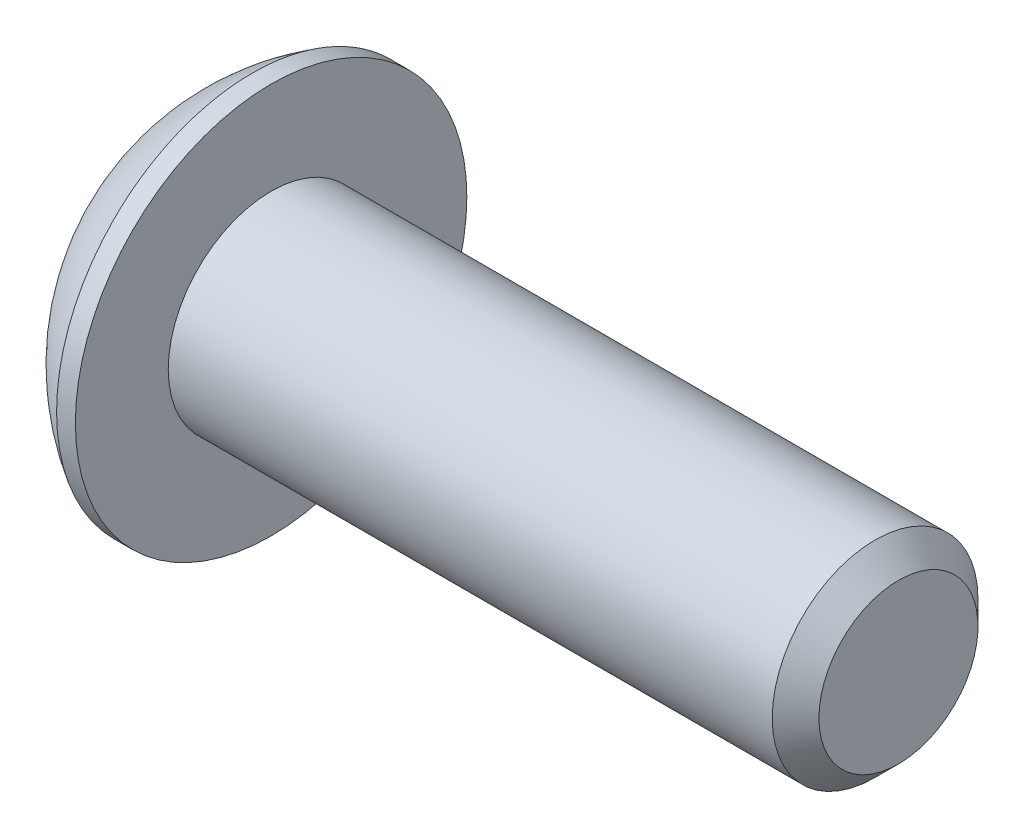
ISO-10303-21;
HEADER;
FILE_DESCRIPTION(('STEP AP214'),'2;1');
FILE_NAME('part.step','',(''),(''),'','','');
FILE_SCHEMA(('AUTOMOTIVE_DESIGN { 1 0 10303 214 1 1 1 1 }'));
ENDSEC;
DATA;
#1=APPLICATION_CONTEXT('core data for automotive mechanical design processes');
#2=APPLICATION_PROTOCOL_DEFINITION('international standard','automotive_design',2000,#1);
#3=PRODUCT_CONTEXT('',#1,'mechanical');
#4=PRODUCT('Part','Part','',(#3));
#5=PRODUCT_RELATED_PRODUCT_CATEGORY('part','',(#4));
#6=PRODUCT_DEFINITION_FORMATION('','',#4);
#7=PRODUCT_DEFINITION_CONTEXT('part definition',#1,'design');
#8=PRODUCT_DEFINITION('design','',#6,#7);
#9=PRODUCT_DEFINITION_SHAPE('','',#8);
#10=(LENGTH_UNIT() NAMED_UNIT(*) SI_UNIT(.MILLI.,.METRE.));
#11=(NAMED_UNIT(*) PLANE_ANGLE_UNIT() SI_UNIT($,.RADIAN.));
#12=(NAMED_UNIT(*) SI_UNIT($,.STERADIAN.) SOLID_ANGLE_UNIT());
#13=UNCERTAINTY_MEASURE_WITH_UNIT(LENGTH_MEASURE(1.E-05),#10,'distance_accuracy_value','');
#14=(GEOMETRIC_REPRESENTATION_CONTEXT(3) GLOBAL_UNCERTAINTY_ASSIGNED_CONTEXT((#13)) GLOBAL_UNIT_ASSIGNED_CONTEXT((#10,
#11,#12)) REPRESENTATION_CONTEXT('',''));
#15=CARTESIAN_POINT('',(0.,0.,0.));
#16=DIRECTION('',(0.,0.,1.));
#17=DIRECTION('',(1.,0.,0.));
#18=AXIS2_PLACEMENT_3D('',#15,#16,#17);
#19=CARTESIAN_POINT('',(1.32080000000034,0.,0.));
#20=DIRECTION('',(-1.,0.,0.));
#21=DIRECTION('',(0.,0.,1.));
#22=AXIS2_PLACEMENT_3D('',#19,#20,#21);
#23=CONICAL_SURFACE('',#22,1.1937999999998,1.04719755119608);
#24=CARTESIAN_POINT('',(2.01004075135902,0.,4.44089209850063E-13));
#25=VERTEX_POINT('',#24);
#26=VERTEX_LOOP('',#25);
#27=FACE_BOUND('',#26,.T.);
#28=CARTESIAN_POINT('',(1.32080000000009,0.,0.));
#29=DIRECTION('',(-1.,0.,0.));
#30=DIRECTION('',(0.,0.,1.));
#31=AXIS2_PLACEMENT_3D('',#28,#29,#30);
#32=CIRCLE('',#31,1.19380000000024);
#33=CARTESIAN_POINT('',(1.32080000000004,0.,1.19380000000012));
#34=VERTEX_POINT('',#33);
#35=CARTESIAN_POINT('',(1.32080000000004,-1.03386112703797,0.596900000000061));
#36=VERTEX_POINT('',#35);
#37=EDGE_CURVE('E21',#34,#36,#32,.F.);
#38=ORIENTED_EDGE('',*,*,#37,.F.);
#39=CARTESIAN_POINT('',(1.32080000000009,0.,0.));
#40=DIRECTION('',(-1.,0.,0.));
#41=DIRECTION('',(0.,0.,1.));
#42=AXIS2_PLACEMENT_3D('',#39,#40,#41);
#43=CIRCLE('',#42,1.19380000000024);
#44=CARTESIAN_POINT('',(1.32080000000004,1.03386112703797,0.596900000000063));
#45=VERTEX_POINT('',#44);
#46=EDGE_CURVE('E91',#45,#34,#43,.F.);
#47=ORIENTED_EDGE('',*,*,#46,.F.);
#48=CARTESIAN_POINT('',(1.32080000000009,0.,0.));
#49=DIRECTION('',(-1.,0.,0.));
#50=DIRECTION('',(0.,0.,1.));
#51=AXIS2_PLACEMENT_3D('',#48,#49,#50);
#52=CIRCLE('',#51,1.19380000000024);
#53=CARTESIAN_POINT('',(1.32080000000004,1.03386112703797,-0.596900000000063));
#54=VERTEX_POINT('',#53);
#55=EDGE_CURVE('E107',#54,#45,#52,.F.);
#56=ORIENTED_EDGE('',*,*,#55,.F.);
#57=CARTESIAN_POINT('',(1.32080000000009,0.,0.));
#58=DIRECTION('',(-1.,0.,0.));
#59=DIRECTION('',(0.,0.,1.));
#60=AXIS2_PLACEMENT_3D('',#57,#58,#59);
#61=CIRCLE('',#60,1.19380000000024);
#62=CARTESIAN_POINT('',(1.32080000000004,1.49420287879031E-12,-1.19380000000012));
#63=VERTEX_POINT('',#62);
#64=EDGE_CURVE('E405',#63,#54,#61,.F.);
#65=ORIENTED_EDGE('',*,*,#64,.F.);
#66=CARTESIAN_POINT('',(1.32080000000009,0.,0.));
#67=DIRECTION('',(-1.,0.,0.));
#68=DIRECTION('',(0.,0.,1.));
#69=AXIS2_PLACEMENT_3D('',#66,#67,#68);
#70=CIRCLE('',#69,1.19380000000024);
#71=CARTESIAN_POINT('',(1.32080000000004,-1.03386112703797,-0.596900000000062));
#72=VERTEX_POINT('',#71);
#73=EDGE_CURVE('E408',#72,#63,#70,.F.);
#74=ORIENTED_EDGE('',*,*,#73,.F.);
#75=CARTESIAN_POINT('',(1.32080000000009,0.,0.));
#76=DIRECTION('',(-1.,0.,0.));
#77=DIRECTION('',(0.,0.,1.));
#78=AXIS2_PLACEMENT_3D('',#75,#76,#77);
#79=CIRCLE('',#78,1.19380000000024);
#80=EDGE_CURVE('E94',#36,#72,#79,.F.);
#81=ORIENTED_EDGE('',*,*,#80,.F.);
#82=EDGE_LOOP('',(#38,#47,#56,#65,#74,#81));
#83=FACE_BOUND('',#82,.T.);
#84=ADVANCED_FACE('F18',(#27,#83),#23,.F.);
#85=CARTESIAN_POINT('',(1.3208,0.,2.3876));
#86=DIRECTION('',(-1.,0.,0.));
#87=DIRECTION('',(0.,0.,1.));
#88=AXIS2_PLACEMENT_3D('',#85,#86,#87);
#89=PLANE('',#88);
#90=DIRECTION('',(0.,1.,0.));
#91=VECTOR('',#90,1.);
#92=CARTESIAN_POINT('',(1.3208,-0.689240751358576,1.1938));
#93=LINE('',#92,#91);
#94=CARTESIAN_POINT('',(1.3208,-0.689240751358576,1.1938));
#95=VERTEX_POINT('',#94);
#96=EDGE_CURVE('E110',#34,#95,#93,.F.);
#97=ORIENTED_EDGE('',*,*,#96,.F.);
#98=ORIENTED_EDGE('',*,*,#37,.T.);
#99=DIRECTION('',(0.,0.5,0.866025403784439));
#100=VECTOR('',#99,1.);
#101=CARTESIAN_POINT('',(1.3208,-1.37848150271715,0.));
#102=LINE('',#101,#100);
#103=EDGE_CURVE('E113',#95,#36,#102,.F.);
#104=ORIENTED_EDGE('',*,*,#103,.F.);
#105=EDGE_LOOP('',(#97,#98,#104));
#106=FACE_BOUND('',#105,.T.);
#107=ADVANCED_FACE('F111',(#106),#89,.T.);
#108=CARTESIAN_POINT('',(1.3208,0.,2.3876));
#109=DIRECTION('',(-1.,0.,0.));
#110=DIRECTION('',(0.,0.,1.));
#111=AXIS2_PLACEMENT_3D('',#108,#109,#110);
#112=PLANE('',#111);
#113=DIRECTION('',(0.,0.5,0.866025403784439));
#114=VECTOR('',#113,1.);
#115=CARTESIAN_POINT('',(1.3208,-1.37848150271715,0.));
#116=LINE('',#115,#114);
#117=CARTESIAN_POINT('',(1.3208,-1.37848150271715,0.));
#118=VERTEX_POINT('',#117);
#119=EDGE_CURVE('E173',#36,#118,#116,.F.);
#120=ORIENTED_EDGE('',*,*,#119,.F.);
#121=ORIENTED_EDGE('',*,*,#80,.T.);
#122=DIRECTION('',(0.,-0.5,0.866025403784439));
#123=VECTOR('',#122,1.);
#124=CARTESIAN_POINT('',(1.3208,-0.689240751358576,-1.1938));
#125=LINE('',#124,#123);
#126=EDGE_CURVE('E161',#118,#72,#125,.F.);
#127=ORIENTED_EDGE('',*,*,#126,.F.);
#128=EDGE_LOOP('',(#120,#121,#127));
#129=FACE_BOUND('',#128,.T.);
#130=ADVANCED_FACE('F250',(#129),#112,.T.);
#131=CARTESIAN_POINT('',(1.3208,0.,2.3876));
#132=DIRECTION('',(-1.,0.,0.));
#133=DIRECTION('',(0.,0.,1.));
#134=AXIS2_PLACEMENT_3D('',#131,#132,#133);
#135=PLANE('',#134);
#136=DIRECTION('',(0.,-0.5,0.866025403784439));
#137=VECTOR('',#136,1.);
#138=CARTESIAN_POINT('',(1.3208,-0.689240751358576,-1.1938));
#139=LINE('',#138,#137);
#140=CARTESIAN_POINT('',(1.3208,-0.689240751358576,-1.1938));
#141=VERTEX_POINT('',#140);
#142=EDGE_CURVE('E158',#72,#141,#139,.F.);
#143=ORIENTED_EDGE('',*,*,#142,.F.);
#144=ORIENTED_EDGE('',*,*,#73,.T.);
#145=DIRECTION('',(0.,-1.,0.));
#146=VECTOR('',#145,1.);
#147=CARTESIAN_POINT('',(1.3208,0.689240751358575,-1.1938));
#148=LINE('',#147,#146);
#149=EDGE_CURVE('E145',#141,#63,#148,.F.);
#150=ORIENTED_EDGE('',*,*,#149,.F.);
#151=EDGE_LOOP('',(#143,#144,#150));
#152=FACE_BOUND('',#151,.T.);
#153=ADVANCED_FACE('F246',(#152),#135,.T.);
#154=CARTESIAN_POINT('',(1.3208,0.,2.3876));
#155=DIRECTION('',(-1.,0.,0.));
#156=DIRECTION('',(0.,0.,1.));
#157=AXIS2_PLACEMENT_3D('',#154,#155,#156);
#158=PLANE('',#157);
#159=DIRECTION('',(0.,-1.,0.));
#160=VECTOR('',#159,1.);
#161=CARTESIAN_POINT('',(1.3208,0.689240751358575,-1.1938));
#162=LINE('',#161,#160);
#163=CARTESIAN_POINT('',(1.3208,0.689240751358575,-1.1938));
#164=VERTEX_POINT('',#163);
#165=EDGE_CURVE('E142',#63,#164,#162,.F.);
#166=ORIENTED_EDGE('',*,*,#165,.F.);
#167=ORIENTED_EDGE('',*,*,#64,.T.);
#168=DIRECTION('',(0.,-0.500000000000001,-0.866025403784438));
#169=VECTOR('',#168,1.);
#170=CARTESIAN_POINT('',(1.3208,1.37848150271715,0.));
#171=LINE('',#170,#169);
#172=EDGE_CURVE('E130',#164,#54,#171,.F.);
#173=ORIENTED_EDGE('',*,*,#172,.F.);
#174=EDGE_LOOP('',(#166,#167,#173));
#175=FACE_BOUND('',#174,.T.);
#176=ADVANCED_FACE('F242',(#175),#158,.T.);
#177=CARTESIAN_POINT('',(1.3208,0.,2.3876));
#178=DIRECTION('',(-1.,0.,0.));
#179=DIRECTION('',(0.,0.,1.));
#180=AXIS2_PLACEMENT_3D('',#177,#178,#179);
#181=PLANE('',#180);
#182=DIRECTION('',(0.,-0.500000000000001,-0.866025403784438));
#183=VECTOR('',#182,1.);
#184=CARTESIAN_POINT('',(1.3208,1.37848150271715,0.));
#185=LINE('',#184,#183);
#186=CARTESIAN_POINT('',(1.3208,1.37848150271715,0.));
#187=VERTEX_POINT('',#186);
#188=EDGE_CURVE('E127',#54,#187,#185,.F.);
#189=ORIENTED_EDGE('',*,*,#188,.F.);
#190=ORIENTED_EDGE('',*,*,#55,.T.);
#191=DIRECTION('',(0.,0.500000000000001,-0.866025403784438));
#192=VECTOR('',#191,1.);
#193=CARTESIAN_POINT('',(1.3208,0.689240751358575,1.1938));
#194=LINE('',#193,#192);
#195=EDGE_CURVE('E150',#187,#45,#194,.F.);
#196=ORIENTED_EDGE('',*,*,#195,.F.);
#197=EDGE_LOOP('',(#189,#190,#196));
#198=FACE_BOUND('',#197,.T.);
#199=ADVANCED_FACE('F239',(#198),#181,.T.);
#200=CARTESIAN_POINT('',(1.3208,0.,2.3876));
#201=DIRECTION('',(-1.,0.,0.));
#202=DIRECTION('',(0.,0.,1.));
#203=AXIS2_PLACEMENT_3D('',#200,#201,#202);
#204=PLANE('',#203);
#205=DIRECTION('',(0.,0.500000000000001,-0.866025403784438));
#206=VECTOR('',#205,1.);
#207=CARTESIAN_POINT('',(1.3208,0.689240751358575,1.1938));
#208=LINE('',#207,#206);
#209=CARTESIAN_POINT('',(1.3208,0.689240751358575,1.1938));
#210=VERTEX_POINT('',#209);
#211=EDGE_CURVE('E105',#45,#210,#208,.F.);
#212=ORIENTED_EDGE('',*,*,#211,.F.);
#213=ORIENTED_EDGE('',*,*,#46,.T.);
#214=DIRECTION('',(0.,1.,0.));
#215=VECTOR('',#214,1.);
#216=CARTESIAN_POINT('',(1.3208,-0.689240751358576,1.1938));
#217=LINE('',#216,#215);
#218=EDGE_CURVE('E102',#210,#34,#217,.F.);
#219=ORIENTED_EDGE('',*,*,#218,.F.);
#220=EDGE_LOOP('',(#212,#213,#219));
#221=FACE_BOUND('',#220,.T.);
#222=ADVANCED_FACE('F100',(#221),#204,.T.);
#223=CARTESIAN_POINT('',(1.3208,-0.689240751358576,1.1938));
#224=DIRECTION('',(0.,0.,-1.));
#225=DIRECTION('',(0.,1.,0.));
#226=AXIS2_PLACEMENT_3D('',#223,#224,#225);
#227=PLANE('',#226);
#228=DIRECTION('',(0.,1.,0.));
#229=VECTOR('',#228,1.);
#230=CARTESIAN_POINT('',(0.,0.,1.1938));
#231=LINE('',#230,#229);
#232=CARTESIAN_POINT('',(0.,0.689240751358575,1.1938));
#233=VERTEX_POINT('',#232);
#234=CARTESIAN_POINT('',(0.,-0.689240751358576,1.1938));
#235=VERTEX_POINT('',#234);
#236=EDGE_CURVE('E134',#233,#235,#231,.F.);
#237=ORIENTED_EDGE('',*,*,#236,.F.);
#238=DIRECTION('',(1.,0.,0.));
#239=VECTOR('',#238,1.);
#240=CARTESIAN_POINT('',(1.3208,0.689240751358575,1.1938));
#241=LINE('',#240,#239);
#242=EDGE_CURVE('E119',#210,#233,#241,.F.);
#243=ORIENTED_EDGE('',*,*,#242,.F.);
#244=ORIENTED_EDGE('',*,*,#218,.T.);
#245=ORIENTED_EDGE('',*,*,#96,.T.);
#246=DIRECTION('',(1.,0.,0.));
#247=VECTOR('',#246,1.);
#248=CARTESIAN_POINT('',(1.3208,-0.689240751358576,1.1938));
#249=LINE('',#248,#247);
#250=EDGE_CURVE('E170',#235,#95,#249,.T.);
#251=ORIENTED_EDGE('',*,*,#250,.F.);
#252=EDGE_LOOP('',(#237,#243,#244,#245,#251));
#253=FACE_BOUND('',#252,.T.);
#254=ADVANCED_FACE('F117',(#253),#227,.T.);
#255=CARTESIAN_POINT('',(1.3208,-1.37848150271715,0.));
#256=DIRECTION('',(0.,0.866025403784439,-0.5));
#257=DIRECTION('',(0.,0.5,0.866025403784439));
#258=AXIS2_PLACEMENT_3D('',#255,#256,#257);
#259=PLANE('',#258);
#260=DIRECTION('',(0.,-0.5,-0.866025403784439));
#261=VECTOR('',#260,1.);
#262=CARTESIAN_POINT('',(0.,-0.689240751358576,1.1938));
#263=LINE('',#262,#261);
#264=CARTESIAN_POINT('',(0.,-1.37848150271715,0.));
#265=VERTEX_POINT('',#264);
#266=EDGE_CURVE('E392',#235,#265,#263,.T.);
#267=ORIENTED_EDGE('',*,*,#266,.F.);
#268=ORIENTED_EDGE('',*,*,#250,.T.);
#269=ORIENTED_EDGE('',*,*,#103,.T.);
#270=ORIENTED_EDGE('',*,*,#119,.T.);
#271=DIRECTION('',(1.,0.,0.));
#272=VECTOR('',#271,1.);
#273=CARTESIAN_POINT('',(1.3208,-1.37848150271715,0.));
#274=LINE('',#273,#272);
#275=EDGE_CURVE('E155',#265,#118,#274,.T.);
#276=ORIENTED_EDGE('',*,*,#275,.F.);
#277=EDGE_LOOP('',(#267,#268,#269,#270,#276));
#278=FACE_BOUND('',#277,.T.);
#279=ADVANCED_FACE('F230',(#278),#259,.T.);
#280=CARTESIAN_POINT('',(1.3208,-0.689240751358576,-1.1938));
#281=DIRECTION('',(0.,0.866025403784439,0.5));
#282=DIRECTION('',(0.,-0.5,0.866025403784439));
#283=AXIS2_PLACEMENT_3D('',#280,#281,#282);
#284=PLANE('',#283);
#285=DIRECTION('',(0.,0.5,-0.866025403784439));
#286=VECTOR('',#285,1.);
#287=CARTESIAN_POINT('',(0.,-1.37848150271715,0.));
#288=LINE('',#287,#286);
#289=CARTESIAN_POINT('',(0.,-0.689240751358576,-1.1938));
#290=VERTEX_POINT('',#289);
#291=EDGE_CURVE('E389',#265,#290,#288,.T.);
#292=ORIENTED_EDGE('',*,*,#291,.F.);
#293=ORIENTED_EDGE('',*,*,#275,.T.);
#294=ORIENTED_EDGE('',*,*,#126,.T.);
#295=ORIENTED_EDGE('',*,*,#142,.T.);
#296=DIRECTION('',(1.,0.,0.));
#297=VECTOR('',#296,1.);
#298=CARTESIAN_POINT('',(1.3208,-0.689240751358576,-1.1938));
#299=LINE('',#298,#297);
#300=EDGE_CURVE('E139',#290,#141,#299,.T.);
#301=ORIENTED_EDGE('',*,*,#300,.F.);
#302=EDGE_LOOP('',(#292,#293,#294,#295,#301));
#303=FACE_BOUND('',#302,.T.);
#304=ADVANCED_FACE('F226',(#303),#284,.T.);
#305=CARTESIAN_POINT('',(1.3208,0.689240751358575,-1.1938));
#306=DIRECTION('',(0.,0.,1.));
#307=DIRECTION('',(0.,-1.,0.));
#308=AXIS2_PLACEMENT_3D('',#305,#306,#307);
#309=PLANE('',#308);
#310=DIRECTION('',(0.,1.,0.));
#311=VECTOR('',#310,1.);
#312=CARTESIAN_POINT('',(0.,0.,-1.1938));
#313=LINE('',#312,#311);
#314=CARTESIAN_POINT('',(0.,0.689240751358575,-1.1938));
#315=VERTEX_POINT('',#314);
#316=EDGE_CURVE('E386',#290,#315,#313,.T.);
#317=ORIENTED_EDGE('',*,*,#316,.F.);
#318=ORIENTED_EDGE('',*,*,#300,.T.);
#319=ORIENTED_EDGE('',*,*,#149,.T.);
#320=ORIENTED_EDGE('',*,*,#165,.T.);
#321=DIRECTION('',(1.,0.,0.));
#322=VECTOR('',#321,1.);
#323=CARTESIAN_POINT('',(1.3208,0.689240751358575,-1.1938));
#324=LINE('',#323,#322);
#325=EDGE_CURVE('E129',#315,#164,#324,.T.);
#326=ORIENTED_EDGE('',*,*,#325,.F.);
#327=EDGE_LOOP('',(#317,#318,#319,#320,#326));
#328=FACE_BOUND('',#327,.T.);
#329=ADVANCED_FACE('F223',(#328),#309,.T.);
#330=CARTESIAN_POINT('',(1.3208,1.37848150271715,0.));
#331=DIRECTION('',(0.,-0.866025403784438,0.500000000000001));
#332=DIRECTION('',(0.,-0.500000000000001,-0.866025403784438));
#333=AXIS2_PLACEMENT_3D('',#330,#331,#332);
#334=PLANE('',#333);
#335=DIRECTION('',(0.,0.500000000000001,0.866025403784438));
#336=VECTOR('',#335,1.);
#337=CARTESIAN_POINT('',(0.,0.689240751358575,-1.1938));
#338=LINE('',#337,#336);
#339=CARTESIAN_POINT('',(0.,1.37848150271715,0.));
#340=VERTEX_POINT('',#339);
#341=EDGE_CURVE('E383',#315,#340,#338,.T.);
#342=ORIENTED_EDGE('',*,*,#341,.F.);
#343=ORIENTED_EDGE('',*,*,#325,.T.);
#344=ORIENTED_EDGE('',*,*,#172,.T.);
#345=ORIENTED_EDGE('',*,*,#188,.T.);
#346=DIRECTION('',(1.,0.,0.));
#347=VECTOR('',#346,1.);
#348=CARTESIAN_POINT('',(1.3208,1.37848150271715,0.));
#349=LINE('',#348,#347);
#350=EDGE_CURVE('E36',#340,#187,#349,.T.);
#351=ORIENTED_EDGE('',*,*,#350,.F.);
#352=EDGE_LOOP('',(#342,#343,#344,#345,#351));
#353=FACE_BOUND('',#352,.T.);
#354=ADVANCED_FACE('F219',(#353),#334,.T.);
#355=CARTESIAN_POINT('',(1.3208,0.689240751358575,1.1938));
#356=DIRECTION('',(0.,-0.866025403784438,-0.500000000000001));
#357=DIRECTION('',(0.,0.500000000000001,-0.866025403784438));
#358=AXIS2_PLACEMENT_3D('',#355,#356,#357);
#359=PLANE('',#358);
#360=DIRECTION('',(0.,-0.500000000000001,0.866025403784438));
#361=VECTOR('',#360,1.);
#362=CARTESIAN_POINT('',(0.,1.37848150271715,0.));
#363=LINE('',#362,#361);
#364=EDGE_CURVE('E205',#340,#233,#363,.T.);
#365=ORIENTED_EDGE('',*,*,#364,.F.);
#366=ORIENTED_EDGE('',*,*,#350,.T.);
#367=ORIENTED_EDGE('',*,*,#195,.T.);
#368=ORIENTED_EDGE('',*,*,#211,.T.);
#369=ORIENTED_EDGE('',*,*,#242,.T.);
#370=EDGE_LOOP('',(#365,#366,#367,#368,#369));
#371=FACE_BOUND('',#370,.T.);
#372=ADVANCED_FACE('F215',(#371),#359,.T.);
#373=CARTESIAN_POINT('',(0.,0.,0.));
#374=DIRECTION('',(-1.,0.,0.));
#375=DIRECTION('',(0.,0.,1.));
#376=AXIS2_PLACEMENT_3D('',#373,#374,#375);
#377=PLANE('',#376);
#378=ORIENTED_EDGE('',*,*,#341,.T.);
#379=ORIENTED_EDGE('',*,*,#364,.T.);
#380=ORIENTED_EDGE('',*,*,#236,.T.);
#381=ORIENTED_EDGE('',*,*,#266,.T.);
#382=ORIENTED_EDGE('',*,*,#291,.T.);
#383=ORIENTED_EDGE('',*,*,#316,.T.);
#384=EDGE_LOOP('',(#378,#379,#380,#381,#382,#383));
#385=FACE_BOUND('',#384,.T.);
#386=CARTESIAN_POINT('',(0.,1.9812,0.));
#387=CARTESIAN_POINT('',(0.,1.9811996664299,0.0556258831179427));
#388=CARTESIAN_POINT('',(0.,1.97885520380442,0.111261989398606));
#389=CARTESIAN_POINT('',(0.,1.96949260169541,0.222149719830457));
#390=CARTESIAN_POINT('',(0.,1.96247308239605,0.277401225602895));
#391=CARTESIAN_POINT('',(0.,1.94379192841038,0.387209508139748));
#392=CARTESIAN_POINT('',(-1.85322082329397E-13,1.93212292489526,0.441765039546366));
#393=CARTESIAN_POINT('',(1.86340500299935E-13,1.90422331175315,0.549729449347494));
#394=CARTESIAN_POINT('',(6.9454332942222E-13,1.88798900035338,0.60313735920887));
#395=CARTESIAN_POINT('',(1.15501983691781E-12,1.832662144765,0.760839131321828));
#396=CARTESIAN_POINT('',(0.,1.78690023648845,0.862876433575428));
#397=CARTESIAN_POINT('',(0.,1.67887358150667,1.05780719540872));
#398=CARTESIAN_POINT('',(9.54250412037226E-13,1.6166082074585,1.15070030720801));
#399=CARTESIAN_POINT('',(5.94776955847561E-13,1.51224157140982,1.28116890915698));
#400=CARTESIAN_POINT('',(1.6313892700342E-13,1.4755970394354,1.32320451127027));
#401=CARTESIAN_POINT('',(-1.62114692902247E-13,1.39893832619713,1.40400288695709));
#402=CARTESIAN_POINT('',(0.,1.35892742784699,1.44276877695455));
#403=CARTESIAN_POINT('',(1.13761909658717E-13,1.23416504602197,1.55382272417904));
#404=CARTESIAN_POINT('',(0.,1.14466125559859,1.62089527952111));
#405=CARTESIAN_POINT('',(0.,0.955712144178163,1.73902218081179));
#406=CARTESIAN_POINT('',(0.,0.85626719823356,1.79007713076007));
#407=CARTESIAN_POINT('',(0.,0.65020634591084,1.87477637530953));
#408=CARTESIAN_POINT('',(0.,0.543590516134852,1.90842085586266));
#409=CARTESIAN_POINT('',(0.,0.326226155292017,1.95733039300656));
#410=CARTESIAN_POINT('',(0.,0.215477602157928,1.97259535144288));
#411=CARTESIAN_POINT('',(0.,-0.00701040587544747,1.98431697865418));
#412=CARTESIAN_POINT('',(0.,-0.118749860774735,1.98077364742916));
#413=CARTESIAN_POINT('',(0.,-0.340050178355486,1.95497485623824));
#414=CARTESIAN_POINT('',(0.,-0.449611052668256,1.93271949620217));
#415=CARTESIAN_POINT('',(0.,-0.663431110729174,1.87014138774524));
#416=CARTESIAN_POINT('',(0.,-0.767690237838521,1.82981844635272));
#417=CARTESIAN_POINT('',(0.,-0.968005760719347,1.73219968377097));
#418=CARTESIAN_POINT('',(0.,-1.0640618469811,1.6749032225164));
#419=CARTESIAN_POINT('',(0.,-1.19980276751283,1.57757371205873));
#420=CARTESIAN_POINT('',(0.,-1.24366557129213,1.54322665019465));
#421=CARTESIAN_POINT('',(0.,-1.32838995706696,1.47093063174263));
#422=CARTESIAN_POINT('',(0.,-1.36924860178706,1.43297823102439));
#423=CARTESIAN_POINT('',(0.,-1.48674671849223,1.31419842051173));
#424=CARTESIAN_POINT('',(0.,-1.55842832343237,1.22836221289312));
#425=CARTESIAN_POINT('',(0.,-1.6863396856475,1.04586168272493));
#426=CARTESIAN_POINT('',(0.,-1.7425700302488,0.949197771949771));
#427=CARTESIAN_POINT('',(0.,-1.8141614250401,0.79818260029868));
#428=CARTESIAN_POINT('',(0.,-1.83591780585875,0.746776203847788));
#429=CARTESIAN_POINT('',(0.,-1.87500754181092,0.642341081688633));
#430=CARTESIAN_POINT('',(0.,-1.89234447645404,0.589313708122844));
#431=CARTESIAN_POINT('',(0.,-1.92246053433555,0.482076273028393));
#432=CARTESIAN_POINT('',(0.,-1.93524685475118,0.427868224257508));
#433=CARTESIAN_POINT('',(0.,-1.95620937250494,0.31857815184461));
#434=CARTESIAN_POINT('',(0.,-1.96438692958147,0.26349639091287));
#435=CARTESIAN_POINT('',(0.,-1.97388528284653,0.173607715038557));
#436=CARTESIAN_POINT('',(0.,-1.97662743364426,0.138944718024997));
#437=CARTESIAN_POINT('',(0.,-1.98028489645283,0.0695224782566998));
#438=CARTESIAN_POINT('',(0.,-1.98120020846367,0.0347632355019629));
#439=CARTESIAN_POINT('',(0.,-1.9811996664299,-0.0556258831179439));
#440=CARTESIAN_POINT('',(0.,-1.97885520380442,-0.111261989398607));
#441=CARTESIAN_POINT('',(0.,-1.96949260169541,-0.222149719830459));
#442=CARTESIAN_POINT('',(0.,-1.96247308239606,-0.277401225602897));
#443=CARTESIAN_POINT('',(0.,-1.94379192841039,-0.387209508139749));
#444=CARTESIAN_POINT('',(-1.85687495073514E-13,-1.93212292489526,-0.441765039546367));
#445=CARTESIAN_POINT('',(1.86706210197E-13,-1.90422331175315,-0.549729449347495));
#446=CARTESIAN_POINT('',(6.95913223380081E-13,-1.88798900035338,-0.603137359208872));
#447=CARTESIAN_POINT('',(1.15748248033081E-12,-1.83266214476501,-0.760839131321831));
#448=CARTESIAN_POINT('',(0.,-1.78690023648846,-0.862876433575432));
#449=CARTESIAN_POINT('',(0.,-1.67887358150667,-1.05780719540872));
#450=CARTESIAN_POINT('',(9.5413180925305E-13,-1.6166082074585,-1.15070030720801));
#451=CARTESIAN_POINT('',(5.94836334946628E-13,-1.51224157140982,-1.28116890915698));
#452=CARTESIAN_POINT('',(1.63155382486304E-13,-1.4755970394354,-1.32320451127027));
#453=CARTESIAN_POINT('',(-1.62131132519566E-13,-1.39893832619713,-1.40400288695709));
#454=CARTESIAN_POINT('',(0.,-1.35892742784699,-1.44276877695455));
#455=CARTESIAN_POINT('',(1.13774829743125E-13,-1.23416504602197,-1.55382272417904));
#456=CARTESIAN_POINT('',(0.,-1.14466125559859,-1.62089527952111));
#457=CARTESIAN_POINT('',(0.,-0.955712144178159,-1.73902218081179));
#458=CARTESIAN_POINT('',(0.,-0.856267198233559,-1.79007713076007));
#459=CARTESIAN_POINT('',(0.,-0.65020634591084,-1.87477637530954));
#460=CARTESIAN_POINT('',(0.,-0.543590516134851,-1.90842085586267));
#461=CARTESIAN_POINT('',(0.,-0.326226155292015,-1.95733039300656));
#462=CARTESIAN_POINT('',(0.,-0.215477602157927,-1.97259535144288));
#463=CARTESIAN_POINT('',(0.,0.00701040587544891,-1.98431697865418));
#464=CARTESIAN_POINT('',(0.,0.118749860774737,-1.98077364742916));
#465=CARTESIAN_POINT('',(0.,0.340050178355488,-1.95497485623824));
#466=CARTESIAN_POINT('',(0.,0.449611052668257,-1.93271949620217));
#467=CARTESIAN_POINT('',(0.,0.663431110729176,-1.87014138774523));
#468=CARTESIAN_POINT('',(0.,0.767690237838524,-1.82981844635272));
#469=CARTESIAN_POINT('',(0.,0.96800576071935,-1.73219968377097));
#470=CARTESIAN_POINT('',(0.,1.0640618469811,-1.6749032225164));
#471=CARTESIAN_POINT('',(0.,1.19980276751283,-1.57757371205873));
#472=CARTESIAN_POINT('',(0.,1.24366557129213,-1.54322665019465));
#473=CARTESIAN_POINT('',(0.,1.32838995706696,-1.47093063174263));
#474=CARTESIAN_POINT('',(0.,1.36924860178706,-1.43297823102439));
#475=CARTESIAN_POINT('',(0.,1.48674671849223,-1.31419842051172));
#476=CARTESIAN_POINT('',(0.,1.55842832343237,-1.22836221289311));
#477=CARTESIAN_POINT('',(0.,1.6863396856475,-1.04586168272493));
#478=CARTESIAN_POINT('',(0.,1.7425700302488,-0.949197771949772));
#479=CARTESIAN_POINT('',(0.,1.8141614250401,-0.798182600298681));
#480=CARTESIAN_POINT('',(0.,1.83591780585875,-0.746776203847787));
#481=CARTESIAN_POINT('',(0.,1.87500754181092,-0.642341081688632));
#482=CARTESIAN_POINT('',(0.,1.89234447645404,-0.589313708122843));
#483=CARTESIAN_POINT('',(0.,1.92246053433555,-0.482076273028391));
#484=CARTESIAN_POINT('',(0.,1.93524685475118,-0.427868224257506));
#485=CARTESIAN_POINT('',(0.,1.95620937250494,-0.318578151844607));
#486=CARTESIAN_POINT('',(0.,1.96438692958147,-0.263496390912867));
#487=CARTESIAN_POINT('',(0.,1.97388528284654,-0.173607715038555));
#488=CARTESIAN_POINT('',(0.,1.97662743364427,-0.138944718024995));
#489=CARTESIAN_POINT('',(0.,1.98028489645283,-0.0695224782566994));
#490=CARTESIAN_POINT('',(0.,1.98120020846367,-0.0347632355019632));
#491=CARTESIAN_POINT('',(0.,1.9812,0.));
#492=B_SPLINE_CURVE_WITH_KNOTS('',3,(#386,#387,#388,#389,#390,#391,#392,#393,#394,#395,#396,
#397,#398,#399,#400,#401,#402,#403,#404,#405,#406,#407,#408,#409,#410,#411,#412,#413,#414,#415,
#416,#417,#418,#419,#420,#421,#422,#423,#424,#425,#426,#427,#428,#429,#430,#431,#432,#433,#434,
#435,#436,#437,#438,#439,#440,#441,#442,#443,#444,#445,#446,#447,#448,#449,#450,#451,#452,#453,
#454,#455,#456,#457,#458,#459,#460,#461,#462,#463,#464,#465,#466,#467,#468,#469,#470,#471,#472,
#473,#474,#475,#476,#477,#478,#479,#480,#481,#482,#483,#484,#485,#486,#487,#488,#489,#490,#491),
.UNSPECIFIED.,.T.,.F.,(4,2,2,2,2,2,2,2,2,2,2,2,2,2,2,2,2,2,2,2,2,2,2,2,2,2,2,2,2,2,2,2,2,2,2,2,
2,2,2,2,2,2,2,2,2,2,2,2,2,2,2,2,4),(0.,0.166845646007828,0.333740557374255,0.500901034367694,
0.668197445942387,1.00199278686282,1.33580081809885,1.50292354032982,1.6698851310853,
2.00370118900129,2.33750465770544,2.67130456115909,3.00510624723801,3.33890793331696,
3.67270783677065,4.00651130547476,4.34032736339026,4.50728895414554,4.67441167637632,
5.00821970761259,5.34201504853332,5.50931146010827,5.67647193710191,5.84336684846844,
6.0102124944764,6.11448220058334,6.21875190669029,6.38559755269812,6.55249246406454,
6.71965294105798,6.88694935263267,7.22074469355311,7.55455272478914,7.72167544702011,
7.88863703777559,8.22245309569158,8.55625656439573,8.89005646784938,9.2238581539283,
9.55765984000725,9.89145974346094,10.225263212165,10.5590792700806,10.7260408608358,
10.8931635830666,11.2269716143029,11.5607669552236,11.7280633667986,11.8952238437922,
12.0621187551587,12.2289644011667,12.3332341072736,12.4375038133806),.UNSPECIFIED.);
#493=CARTESIAN_POINT('',(0.,1.9812,0.));
#494=VERTEX_POINT('',#493);
#495=EDGE_CURVE('E199',#494,#494,#492,.T.);
#496=ORIENTED_EDGE('',*,*,#495,.F.);
#497=EDGE_LOOP('',(#496));
#498=FACE_BOUND('',#497,.T.);
#499=ADVANCED_FACE('F211',(#385,#498),#377,.T.);
#500=CARTESIAN_POINT('',(4.13385,0.,0.));
#501=DIRECTION('',(0.,1.,0.));
#502=DIRECTION('',(1.,0.,0.));
#503=AXIS2_PLACEMENT_3D('',#500,#501,#502);
#504=SPHERICAL_SURFACE('',#503,4.58408870578439);
#505=CARTESIAN_POINT('',(1.8288,0.,0.));
#506=DIRECTION('',(-1.,0.,0.));
#507=DIRECTION('',(0.,0.,1.));
#508=AXIS2_PLACEMENT_3D('',#505,#506,#507);
#509=CIRCLE('',#508,3.9624);
#510=CARTESIAN_POINT('',(1.8288,0.,3.9624));
#511=VERTEX_POINT('',#510);
#512=EDGE_CURVE('E196',#511,#511,#509,.F.);
#513=ORIENTED_EDGE('',*,*,#512,.F.);
#514=EDGE_LOOP('',(#513));
#515=FACE_BOUND('',#514,.T.);
#516=ORIENTED_EDGE('',*,*,#495,.T.);
#517=EDGE_LOOP('',(#516));
#518=FACE_BOUND('',#517,.T.);
#519=ADVANCED_FACE('F207',(#515,#518),#504,.T.);
#520=CARTESIAN_POINT('',(14.9098,0.,0.));
#521=DIRECTION('',(-1.,0.,0.));
#522=DIRECTION('',(0.,0.,1.));
#523=AXIS2_PLACEMENT_3D('',#520,#521,#522);
#524=PLANE('',#523);
#525=CARTESIAN_POINT('',(14.9098000000549,0.,0.));
#526=DIRECTION('',(-1.,0.,0.));
#527=DIRECTION('',(0.,0.,1.));
#528=AXIS2_PLACEMENT_3D('',#525,#526,#527);
#529=CIRCLE('',#528,1.61036000002923);
#530=CARTESIAN_POINT('',(14.9098000000549,0.,1.61036000002923));
#531=VERTEX_POINT('',#530);
#532=EDGE_CURVE('E193',#531,#531,#529,.T.);
#533=ORIENTED_EDGE('',*,*,#532,.F.);
#534=EDGE_LOOP('',(#533));
#535=FACE_BOUND('',#534,.T.);
#536=ADVANCED_FACE('F278',(#535),#524,.F.);
#537=CARTESIAN_POINT('',(0.,0.,0.));
#538=DIRECTION('',(-1.,0.,0.));
#539=DIRECTION('',(0.,0.,1.));
#540=AXIS2_PLACEMENT_3D('',#537,#538,#539);
#541=CYLINDRICAL_SURFACE('',#540,3.9624);
#542=ORIENTED_EDGE('',*,*,#512,.T.);
#543=EDGE_LOOP('',(#542));
#544=FACE_BOUND('',#543,.T.);
#545=CARTESIAN_POINT('',(2.2098,0.,0.));
#546=DIRECTION('',(-1.,0.,0.));
#547=DIRECTION('',(0.,0.,1.));
#548=AXIS2_PLACEMENT_3D('',#545,#546,#547);
#549=CIRCLE('',#548,3.9624);
#550=CARTESIAN_POINT('',(2.2098,0.,3.9624));
#551=VERTEX_POINT('',#550);
#552=EDGE_CURVE('E190',#551,#551,#549,.T.);
#553=ORIENTED_EDGE('',*,*,#552,.T.);
#554=EDGE_LOOP('',(#553));
#555=FACE_BOUND('',#554,.T.);
#556=ADVANCED_FACE('F275',(#544,#555),#541,.T.);
#557=CARTESIAN_POINT('',(14.4373599999881,0.,0.));
#558=DIRECTION('',(-1.,0.,0.));
#559=DIRECTION('',(0.,0.,1.));
#560=AXIS2_PLACEMENT_3D('',#557,#558,#559);
#561=CONICAL_SURFACE('',#560,2.08280000003924,0.785398163337289);
#562=CARTESIAN_POINT('',(14.43736,0.,0.));
#563=DIRECTION('',(-1.,0.,0.));
#564=DIRECTION('',(0.,0.,1.));
#565=AXIS2_PLACEMENT_3D('',#562,#563,#564);
#566=CIRCLE('',#565,2.0828);
#567=CARTESIAN_POINT('',(14.43736,0.,2.0828));
#568=VERTEX_POINT('',#567);
#569=EDGE_CURVE('E27',#568,#568,#566,.T.);
#570=ORIENTED_EDGE('',*,*,#569,.F.);
#571=EDGE_LOOP('',(#570));
#572=FACE_BOUND('',#571,.T.);
#573=ORIENTED_EDGE('',*,*,#532,.T.);
#574=EDGE_LOOP('',(#573));
#575=FACE_BOUND('',#574,.T.);
#576=ADVANCED_FACE('F268',(#572,#575),#561,.T.);
#577=CARTESIAN_POINT('',(2.2098,2.0828,0.));
#578=DIRECTION('',(-1.,0.,0.));
#579=DIRECTION('',(0.,0.,1.));
#580=AXIS2_PLACEMENT_3D('',#577,#578,#579);
#581=PLANE('',#580);
#582=CARTESIAN_POINT('',(2.2098,0.,0.));
#583=DIRECTION('',(-1.,0.,0.));
#584=DIRECTION('',(0.,0.,1.));
#585=AXIS2_PLACEMENT_3D('',#582,#583,#584);
#586=CIRCLE('',#585,2.0828);
#587=CARTESIAN_POINT('',(2.2098,0.,2.0828));
#588=VERTEX_POINT('',#587);
#589=EDGE_CURVE('E11',#588,#588,#586,.F.);
#590=ORIENTED_EDGE('',*,*,#589,.F.);
#591=EDGE_LOOP('',(#590));
#592=FACE_BOUND('',#591,.T.);
#593=ORIENTED_EDGE('',*,*,#552,.F.);
#594=EDGE_LOOP('',(#593));
#595=FACE_BOUND('',#594,.T.);
#596=ADVANCED_FACE('F262',(#592,#595),#581,.F.);
#597=CARTESIAN_POINT('',(0.,0.,0.));
#598=DIRECTION('',(-1.,0.,0.));
#599=DIRECTION('',(0.,0.,1.));
#600=AXIS2_PLACEMENT_3D('',#597,#598,#599);
#601=CYLINDRICAL_SURFACE('',#600,2.0828);
#602=ORIENTED_EDGE('',*,*,#589,.T.);
#603=EDGE_LOOP('',(#602));
#604=FACE_BOUND('',#603,.T.);
#605=ORIENTED_EDGE('',*,*,#569,.T.);
#606=EDGE_LOOP('',(#605));
#607=FACE_BOUND('',#606,.T.);
#608=ADVANCED_FACE('F260',(#604,#607),#601,.T.);
#609=CLOSED_SHELL('',(#84,#107,#130,#153,#176,#199,#222,#254,#279,#304,#329,#354,#372,#499,#519,
#536,#556,#576,#596,#608));
#610=MANIFOLD_SOLID_BREP('B1',#609);
#611=ADVANCED_BREP_SHAPE_REPRESENTATION('',(#18,#610),#14);
#612=SHAPE_DEFINITION_REPRESENTATION(#9,#611);
ENDSEC;
END-ISO-10303-21;
